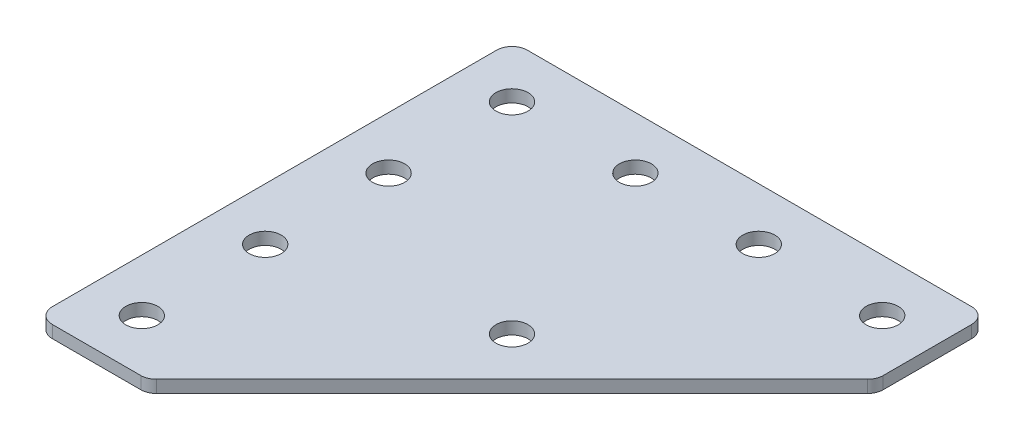
ISO-10303-21;
HEADER;
FILE_DESCRIPTION(('STEP AP214'),'2;1');
FILE_NAME('part.step','',(''),(''),'','','');
FILE_SCHEMA(('AUTOMOTIVE_DESIGN { 1 0 10303 214 1 1 1 1 }'));
ENDSEC;
DATA;
#1=APPLICATION_CONTEXT('core data for automotive mechanical design processes');
#2=APPLICATION_PROTOCOL_DEFINITION('international standard','automotive_design',2000,#1);
#3=PRODUCT_CONTEXT('',#1,'mechanical');
#4=PRODUCT('Part','Part','',(#3));
#5=PRODUCT_RELATED_PRODUCT_CATEGORY('part','',(#4));
#6=PRODUCT_DEFINITION_FORMATION('','',#4);
#7=PRODUCT_DEFINITION_CONTEXT('part definition',#1,'design');
#8=PRODUCT_DEFINITION('design','',#6,#7);
#9=PRODUCT_DEFINITION_SHAPE('','',#8);
#10=(LENGTH_UNIT() NAMED_UNIT(*) SI_UNIT(.MILLI.,.METRE.));
#11=(NAMED_UNIT(*) PLANE_ANGLE_UNIT() SI_UNIT($,.RADIAN.));
#12=(NAMED_UNIT(*) SI_UNIT($,.STERADIAN.) SOLID_ANGLE_UNIT());
#13=UNCERTAINTY_MEASURE_WITH_UNIT(LENGTH_MEASURE(1.E-05),#10,'distance_accuracy_value','');
#14=(GEOMETRIC_REPRESENTATION_CONTEXT(3) GLOBAL_UNCERTAINTY_ASSIGNED_CONTEXT((#13)) GLOBAL_UNIT_ASSIGNED_CONTEXT((#10,
#11,#12)) REPRESENTATION_CONTEXT('',''));
#15=CARTESIAN_POINT('',(0.,0.,0.));
#16=DIRECTION('',(0.,0.,1.));
#17=DIRECTION('',(1.,0.,0.));
#18=AXIS2_PLACEMENT_3D('',#15,#16,#17);
#19=CARTESIAN_POINT('',(-30.9410023545228,1.05807034319605,-31.1167335219397));
#20=DIRECTION('',(0.,-1.,0.));
#21=DIRECTION('',(0.,0.,-1.));
#22=AXIS2_PLACEMENT_3D('',#19,#20,#21);
#23=PLANE('',#22);
#24=CARTESIAN_POINT('',(1.63437644301843,1.05807034319605,1.45864527560156));
#25=DIRECTION('',(0.,-1.,0.));
#26=DIRECTION('',(0.,0.,-1.));
#27=AXIS2_PLACEMENT_3D('',#24,#25,#26);
#28=CIRCLE('',#27,2.6);
#29=CARTESIAN_POINT('',(1.63437644301843,1.05807034319605,-1.14135472439844));
#30=VERTEX_POINT('',#29);
#31=EDGE_CURVE('E226',#30,#30,#28,.T.);
#32=ORIENTED_EDGE('',*,*,#31,.F.);
#33=EDGE_LOOP('',(#32));
#34=FACE_BOUND('',#33,.T.);
#35=CARTESIAN_POINT('',(29.0589976454772,1.05807034319605,-31.1167335219397));
#36=DIRECTION('',(0.,1.,0.));
#37=DIRECTION('',(0.,0.,1.));
#38=AXIS2_PLACEMENT_3D('',#35,#36,#37);
#39=CIRCLE('',#38,2.6);
#40=CARTESIAN_POINT('',(29.0589976454772,1.05807034319605,-28.5167335219397));
#41=VERTEX_POINT('',#40);
#42=EDGE_CURVE('E220',#41,#41,#39,.T.);
#43=ORIENTED_EDGE('',*,*,#42,.T.);
#44=EDGE_LOOP('',(#43));
#45=FACE_BOUND('',#44,.T.);
#46=CARTESIAN_POINT('',(-30.9410023545228,1.05807034319605,28.8832664780603));
#47=DIRECTION('',(0.,1.,0.));
#48=DIRECTION('',(0.,0.,1.));
#49=AXIS2_PLACEMENT_3D('',#46,#47,#48);
#50=CIRCLE('',#49,2.6);
#51=CARTESIAN_POINT('',(-30.9410023545228,1.05807034319605,31.4832664780603));
#52=VERTEX_POINT('',#51);
#53=EDGE_CURVE('E214',#52,#52,#50,.T.);
#54=ORIENTED_EDGE('',*,*,#53,.T.);
#55=EDGE_LOOP('',(#54));
#56=FACE_BOUND('',#55,.T.);
#57=CARTESIAN_POINT('',(9.05899764547718,1.05807034319605,-31.1167335219397));
#58=DIRECTION('',(0.,1.,0.));
#59=DIRECTION('',(0.,0.,1.));
#60=AXIS2_PLACEMENT_3D('',#57,#58,#59);
#61=CIRCLE('',#60,2.6);
#62=CARTESIAN_POINT('',(9.05899764547718,1.05807034319605,-28.5167335219397));
#63=VERTEX_POINT('',#62);
#64=EDGE_CURVE('E208',#63,#63,#61,.T.);
#65=ORIENTED_EDGE('',*,*,#64,.T.);
#66=EDGE_LOOP('',(#65));
#67=FACE_BOUND('',#66,.T.);
#68=CARTESIAN_POINT('',(-30.9410023545228,1.05807034319605,8.88326647806029));
#69=DIRECTION('',(0.,1.,0.));
#70=DIRECTION('',(0.,0.,1.));
#71=AXIS2_PLACEMENT_3D('',#68,#69,#70);
#72=CIRCLE('',#71,2.6);
#73=CARTESIAN_POINT('',(-30.9410023545228,1.05807034319605,11.4832664780603));
#74=VERTEX_POINT('',#73);
#75=EDGE_CURVE('E202',#74,#74,#72,.T.);
#76=ORIENTED_EDGE('',*,*,#75,.T.);
#77=EDGE_LOOP('',(#76));
#78=FACE_BOUND('',#77,.T.);
#79=CARTESIAN_POINT('',(-30.9410023545228,1.05807034319605,-11.1167335219397));
#80=DIRECTION('',(0.,1.,0.));
#81=DIRECTION('',(0.,0.,1.));
#82=AXIS2_PLACEMENT_3D('',#79,#80,#81);
#83=CIRCLE('',#82,2.6);
#84=CARTESIAN_POINT('',(-30.9410023545228,1.05807034319605,-8.51673352193971));
#85=VERTEX_POINT('',#84);
#86=EDGE_CURVE('E196',#85,#85,#83,.T.);
#87=ORIENTED_EDGE('',*,*,#86,.T.);
#88=EDGE_LOOP('',(#87));
#89=FACE_BOUND('',#88,.T.);
#90=CARTESIAN_POINT('',(-10.9410023545228,1.05807034319605,-31.1167335219397));
#91=DIRECTION('',(0.,1.,0.));
#92=DIRECTION('',(0.,0.,1.));
#93=AXIS2_PLACEMENT_3D('',#90,#91,#92);
#94=CIRCLE('',#93,2.6);
#95=CARTESIAN_POINT('',(-10.9410023545228,1.05807034319605,-28.5167335219397));
#96=VERTEX_POINT('',#95);
#97=EDGE_CURVE('E190',#96,#96,#94,.T.);
#98=ORIENTED_EDGE('',*,*,#97,.T.);
#99=EDGE_LOOP('',(#98));
#100=FACE_BOUND('',#99,.T.);
#101=CARTESIAN_POINT('',(-30.9410023545228,1.05807034319605,-31.1167335219397));
#102=DIRECTION('',(0.,1.,0.));
#103=DIRECTION('',(0.,0.,1.));
#104=AXIS2_PLACEMENT_3D('',#101,#102,#103);
#105=CIRCLE('',#104,2.6);
#106=CARTESIAN_POINT('',(-30.9410023545228,1.05807034319605,-28.5167335219397));
#107=VERTEX_POINT('',#106);
#108=EDGE_CURVE('E180',#107,#107,#105,.T.);
#109=ORIENTED_EDGE('',*,*,#108,.T.);
#110=EDGE_LOOP('',(#109));
#111=FACE_BOUND('',#110,.T.);
#112=DIRECTION('',(1.,0.,0.));
#113=VECTOR('',#112,1.);
#114=CARTESIAN_POINT('',(-39.4410023545229,1.05807034319605,37.3832664780602));
#115=LINE('',#114,#113);
#116=CARTESIAN_POINT('',(-36.9410023545229,1.05807034319605,37.3832664780602));
#117=VERTEX_POINT('',#116);
#118=CARTESIAN_POINT('',(-22.5978566040151,1.05807034319605,37.3832664780603));
#119=VERTEX_POINT('',#118);
#120=EDGE_CURVE('E183',#117,#119,#115,.T.);
#121=ORIENTED_EDGE('',*,*,#120,.F.);
#122=CARTESIAN_POINT('',(-36.9410023545229,1.05807034319605,34.8832664780602));
#123=DIRECTION('',(0.,-1.,0.));
#124=DIRECTION('',(0.,0.,-1.));
#125=AXIS2_PLACEMENT_3D('',#122,#123,#124);
#126=CIRCLE('',#125,2.5);
#127=CARTESIAN_POINT('',(-39.4410023545229,1.05807034319605,34.8832664780602));
#128=VERTEX_POINT('',#127);
#129=EDGE_CURVE('E147',#117,#128,#126,.T.);
#130=ORIENTED_EDGE('',*,*,#129,.T.);
#131=DIRECTION('',(0.,0.,1.));
#132=VECTOR('',#131,1.);
#133=CARTESIAN_POINT('',(-39.4410023545229,1.05807034319605,-39.6167335219398));
#134=LINE('',#133,#132);
#135=CARTESIAN_POINT('',(-39.4410023545229,1.05807034319605,-37.1167335219398));
#136=VERTEX_POINT('',#135);
#137=EDGE_CURVE('E166',#136,#128,#134,.T.);
#138=ORIENTED_EDGE('',*,*,#137,.F.);
#139=CARTESIAN_POINT('',(-36.9410023545229,1.05807034319605,-37.1167335219398));
#140=DIRECTION('',(0.,-1.,0.));
#141=DIRECTION('',(0.,0.,-1.));
#142=AXIS2_PLACEMENT_3D('',#139,#140,#141);
#143=CIRCLE('',#142,2.5);
#144=CARTESIAN_POINT('',(-36.9410023545229,1.05807034319605,-39.6167335219398));
#145=VERTEX_POINT('',#144);
#146=EDGE_CURVE('E119',#136,#145,#143,.T.);
#147=ORIENTED_EDGE('',*,*,#146,.T.);
#148=DIRECTION('',(-1.,0.,0.));
#149=VECTOR('',#148,1.);
#150=CARTESIAN_POINT('',(37.5589976454771,1.05807034319605,-39.6167335219398));
#151=LINE('',#150,#149);
#152=CARTESIAN_POINT('',(35.0589976454771,1.05807034319605,-39.6167335219398));
#153=VERTEX_POINT('',#152);
#154=EDGE_CURVE('E162',#153,#145,#151,.T.);
#155=ORIENTED_EDGE('',*,*,#154,.F.);
#156=CARTESIAN_POINT('',(35.0589976454771,1.05807034319605,-37.1167335219398));
#157=DIRECTION('',(0.,-1.,0.));
#158=DIRECTION('',(0.,0.,-1.));
#159=AXIS2_PLACEMENT_3D('',#156,#157,#158);
#160=CIRCLE('',#159,2.5);
#161=CARTESIAN_POINT('',(37.5589976454771,1.05807034319605,-37.1167335219398));
#162=VERTEX_POINT('',#161);
#163=EDGE_CURVE('E145',#153,#162,#160,.T.);
#164=ORIENTED_EDGE('',*,*,#163,.T.);
#165=DIRECTION('',(0.,0.,-1.));
#166=VECTOR('',#165,1.);
#167=CARTESIAN_POINT('',(37.5589976454771,1.05807034319605,-21.7380538654993));
#168=LINE('',#167,#166);
#169=CARTESIAN_POINT('',(37.5589976454771,1.05807034319605,-22.773587771432));
#170=VERTEX_POINT('',#169);
#171=EDGE_CURVE('E120',#170,#162,#168,.T.);
#172=ORIENTED_EDGE('',*,*,#171,.F.);
#173=CARTESIAN_POINT('',(35.0589976454771,1.05807034319605,-22.773587771432));
#174=DIRECTION('',(0.,-1.,0.));
#175=DIRECTION('',(0.,0.,-1.));
#176=AXIS2_PLACEMENT_3D('',#173,#174,#175);
#177=CIRCLE('',#176,2.5);
#178=CARTESIAN_POINT('',(36.8267645984435,1.05807034319605,-21.0058208184657));
#179=VERTEX_POINT('',#178);
#180=EDGE_CURVE('E31',#170,#179,#177,.T.);
#181=ORIENTED_EDGE('',*,*,#180,.T.);
#182=DIRECTION('',(0.707106781186547,0.,-0.707106781186548));
#183=VECTOR('',#182,1.);
#184=CARTESIAN_POINT('',(-21.5623226980824,1.05807034319605,37.3832664780603));
#185=LINE('',#184,#183);
#186=CARTESIAN_POINT('',(-20.8300896510488,1.05807034319605,36.6510334310266));
#187=VERTEX_POINT('',#186);
#188=EDGE_CURVE('E125',#187,#179,#185,.T.);
#189=ORIENTED_EDGE('',*,*,#188,.F.);
#190=CARTESIAN_POINT('',(-22.5978566040151,1.05807034319605,34.8832664780603));
#191=DIRECTION('',(0.,-1.,0.));
#192=DIRECTION('',(0.,0.,-1.));
#193=AXIS2_PLACEMENT_3D('',#190,#191,#192);
#194=CIRCLE('',#193,2.5);
#195=EDGE_CURVE('E141',#187,#119,#194,.T.);
#196=ORIENTED_EDGE('',*,*,#195,.T.);
#197=EDGE_LOOP('',(#121,#130,#138,#147,#155,#164,#172,#181,#189,#196));
#198=FACE_BOUND('',#197,.T.);
#199=ADVANCED_FACE('F16',(#34,#45,#56,#67,#78,#89,#100,#111,#198),#23,.T.);
#200=CARTESIAN_POINT('',(37.5589976454771,1.05807034319605,-39.6167335219398));
#201=DIRECTION('',(0.,0.,-1.));
#202=DIRECTION('',(-1.,0.,0.));
#203=AXIS2_PLACEMENT_3D('',#200,#201,#202);
#204=PLANE('',#203);
#205=DIRECTION('',(-1.,0.,0.));
#206=VECTOR('',#205,1.);
#207=CARTESIAN_POINT('',(37.5589976454771,3.05807034319605,-39.6167335219398));
#208=LINE('',#207,#206);
#209=CARTESIAN_POINT('',(35.0589976454771,3.05807034319605,-39.6167335219398));
#210=VERTEX_POINT('',#209);
#211=CARTESIAN_POINT('',(-36.9410023545229,3.05807034319605,-39.6167335219398));
#212=VERTEX_POINT('',#211);
#213=EDGE_CURVE('E99',#210,#212,#208,.T.);
#214=ORIENTED_EDGE('',*,*,#213,.F.);
#215=DIRECTION('',(0.,1.,0.));
#216=VECTOR('',#215,1.);
#217=CARTESIAN_POINT('',(35.0589976454771,1.05807034319605,-39.6167335219398));
#218=LINE('',#217,#216);
#219=EDGE_CURVE('E156',#210,#153,#218,.F.);
#220=ORIENTED_EDGE('',*,*,#219,.T.);
#221=ORIENTED_EDGE('',*,*,#154,.T.);
#222=DIRECTION('',(0.,1.,0.));
#223=VECTOR('',#222,1.);
#224=CARTESIAN_POINT('',(-36.9410023545229,1.05807034319605,-39.6167335219398));
#225=LINE('',#224,#223);
#226=EDGE_CURVE('E154',#145,#212,#225,.T.);
#227=ORIENTED_EDGE('',*,*,#226,.T.);
#228=EDGE_LOOP('',(#214,#220,#221,#227));
#229=FACE_BOUND('',#228,.T.);
#230=ADVANCED_FACE('F161',(#229),#204,.T.);
#231=CARTESIAN_POINT('',(37.5589976454771,1.05807034319605,-21.7380538654993));
#232=DIRECTION('',(1.,0.,0.));
#233=DIRECTION('',(0.,0.,-1.));
#234=AXIS2_PLACEMENT_3D('',#231,#232,#233);
#235=PLANE('',#234);
#236=ORIENTED_EDGE('',*,*,#171,.T.);
#237=DIRECTION('',(0.,1.,0.));
#238=VECTOR('',#237,1.);
#239=CARTESIAN_POINT('',(37.5589976454771,1.05807034319605,-37.1167335219398));
#240=LINE('',#239,#238);
#241=CARTESIAN_POINT('',(37.5589976454771,3.05807034319605,-37.1167335219398));
#242=VERTEX_POINT('',#241);
#243=EDGE_CURVE('E151',#162,#242,#240,.T.);
#244=ORIENTED_EDGE('',*,*,#243,.T.);
#245=DIRECTION('',(0.,0.,-1.));
#246=VECTOR('',#245,1.);
#247=CARTESIAN_POINT('',(37.5589976454771,3.05807034319605,-21.7380538654993));
#248=LINE('',#247,#246);
#249=CARTESIAN_POINT('',(37.5589976454771,3.05807034319605,-22.773587771432));
#250=VERTEX_POINT('',#249);
#251=EDGE_CURVE('E128',#250,#242,#248,.T.);
#252=ORIENTED_EDGE('',*,*,#251,.F.);
#253=DIRECTION('',(0.,1.,0.));
#254=VECTOR('',#253,1.);
#255=CARTESIAN_POINT('',(37.5589976454771,1.05807034319605,-22.773587771432));
#256=LINE('',#255,#254);
#257=EDGE_CURVE('E149',#250,#170,#256,.F.);
#258=ORIENTED_EDGE('',*,*,#257,.T.);
#259=EDGE_LOOP('',(#236,#244,#252,#258));
#260=FACE_BOUND('',#259,.T.);
#261=ADVANCED_FACE('F173',(#260),#235,.T.);
#262=CARTESIAN_POINT('',(-21.5623226980824,1.05807034319605,37.3832664780603));
#263=DIRECTION('',(0.707106781186548,0.,0.707106781186547));
#264=DIRECTION('',(0.707106781186547,0.,-0.707106781186548));
#265=AXIS2_PLACEMENT_3D('',#262,#263,#264);
#266=PLANE('',#265);
#267=ORIENTED_EDGE('',*,*,#188,.T.);
#268=DIRECTION('',(0.,1.,0.));
#269=VECTOR('',#268,1.);
#270=CARTESIAN_POINT('',(36.8267645984435,1.05807034319605,-21.0058208184657));
#271=LINE('',#270,#269);
#272=CARTESIAN_POINT('',(36.8267645984435,3.05807034319605,-21.0058208184657));
#273=VERTEX_POINT('',#272);
#274=EDGE_CURVE('E10',#179,#273,#271,.T.);
#275=ORIENTED_EDGE('',*,*,#274,.T.);
#276=DIRECTION('',(0.707106781186547,0.,-0.707106781186548));
#277=VECTOR('',#276,1.);
#278=CARTESIAN_POINT('',(-21.5623226980824,3.05807034319605,37.3832664780603));
#279=LINE('',#278,#277);
#280=CARTESIAN_POINT('',(-20.8300896510488,3.05807034319605,36.6510334310266));
#281=VERTEX_POINT('',#280);
#282=EDGE_CURVE('E176',#281,#273,#279,.T.);
#283=ORIENTED_EDGE('',*,*,#282,.F.);
#284=DIRECTION('',(0.,1.,0.));
#285=VECTOR('',#284,1.);
#286=CARTESIAN_POINT('',(-20.8300896510488,1.05807034319605,36.6510334310266));
#287=LINE('',#286,#285);
#288=EDGE_CURVE('E24',#281,#187,#287,.F.);
#289=ORIENTED_EDGE('',*,*,#288,.T.);
#290=EDGE_LOOP('',(#267,#275,#283,#289));
#291=FACE_BOUND('',#290,.T.);
#292=ADVANCED_FACE('F294',(#291),#266,.T.);
#293=CARTESIAN_POINT('',(-39.4410023545229,1.05807034319605,37.3832664780602));
#294=DIRECTION('',(0.,0.,1.));
#295=DIRECTION('',(1.,0.,0.));
#296=AXIS2_PLACEMENT_3D('',#293,#294,#295);
#297=PLANE('',#296);
#298=DIRECTION('',(1.,0.,0.));
#299=VECTOR('',#298,1.);
#300=CARTESIAN_POINT('',(-39.4410023545229,3.05807034319605,37.3832664780602));
#301=LINE('',#300,#299);
#302=CARTESIAN_POINT('',(-36.9410023545229,3.05807034319605,37.3832664780602));
#303=VERTEX_POINT('',#302);
#304=CARTESIAN_POINT('',(-22.5978566040151,3.05807034319605,37.3832664780603));
#305=VERTEX_POINT('',#304);
#306=EDGE_CURVE('E115',#303,#305,#301,.T.);
#307=ORIENTED_EDGE('',*,*,#306,.F.);
#308=DIRECTION('',(0.,1.,0.));
#309=VECTOR('',#308,1.);
#310=CARTESIAN_POINT('',(-36.9410023545229,1.05807034319605,37.3832664780602));
#311=LINE('',#310,#309);
#312=EDGE_CURVE('E139',#303,#117,#311,.F.);
#313=ORIENTED_EDGE('',*,*,#312,.T.);
#314=ORIENTED_EDGE('',*,*,#120,.T.);
#315=DIRECTION('',(0.,1.,0.));
#316=VECTOR('',#315,1.);
#317=CARTESIAN_POINT('',(-22.5978566040151,1.05807034319605,37.3832664780603));
#318=LINE('',#317,#316);
#319=EDGE_CURVE('E136',#119,#305,#318,.T.);
#320=ORIENTED_EDGE('',*,*,#319,.T.);
#321=EDGE_LOOP('',(#307,#313,#314,#320));
#322=FACE_BOUND('',#321,.T.);
#323=ADVANCED_FACE('F299',(#322),#297,.T.);
#324=CARTESIAN_POINT('',(-39.4410023545229,1.05807034319605,-39.6167335219398));
#325=DIRECTION('',(-1.,0.,0.));
#326=DIRECTION('',(0.,0.,1.));
#327=AXIS2_PLACEMENT_3D('',#324,#325,#326);
#328=PLANE('',#327);
#329=ORIENTED_EDGE('',*,*,#137,.T.);
#330=DIRECTION('',(0.,1.,0.));
#331=VECTOR('',#330,1.);
#332=CARTESIAN_POINT('',(-39.4410023545229,1.05807034319605,34.8832664780602));
#333=LINE('',#332,#331);
#334=CARTESIAN_POINT('',(-39.4410023545229,3.05807034319605,34.8832664780602));
#335=VERTEX_POINT('',#334);
#336=EDGE_CURVE('E114',#128,#335,#333,.T.);
#337=ORIENTED_EDGE('',*,*,#336,.T.);
#338=DIRECTION('',(0.,0.,1.));
#339=VECTOR('',#338,1.);
#340=CARTESIAN_POINT('',(-39.4410023545229,3.05807034319605,-39.6167335219398));
#341=LINE('',#340,#339);
#342=CARTESIAN_POINT('',(-39.4410023545229,3.05807034319605,-37.1167335219398));
#343=VERTEX_POINT('',#342);
#344=EDGE_CURVE('E97',#343,#335,#341,.T.);
#345=ORIENTED_EDGE('',*,*,#344,.F.);
#346=DIRECTION('',(0.,1.,0.));
#347=VECTOR('',#346,1.);
#348=CARTESIAN_POINT('',(-39.4410023545229,1.05807034319605,-37.1167335219398));
#349=LINE('',#348,#347);
#350=EDGE_CURVE('E111',#343,#136,#349,.F.);
#351=ORIENTED_EDGE('',*,*,#350,.T.);
#352=EDGE_LOOP('',(#329,#337,#345,#351));
#353=FACE_BOUND('',#352,.T.);
#354=ADVANCED_FACE('F110',(#353),#328,.T.);
#355=CARTESIAN_POINT('',(-30.9410023545228,3.05807034319605,-31.1167335219397));
#356=DIRECTION('',(0.,-1.,0.));
#357=DIRECTION('',(0.,0.,-1.));
#358=AXIS2_PLACEMENT_3D('',#355,#356,#357);
#359=PLANE('',#358);
#360=CARTESIAN_POINT('',(1.63437644301843,3.05807034319605,1.45864527560156));
#361=DIRECTION('',(0.,1.,0.));
#362=DIRECTION('',(0.,0.,1.));
#363=AXIS2_PLACEMENT_3D('',#360,#361,#362);
#364=CIRCLE('',#363,2.6);
#365=CARTESIAN_POINT('',(1.63437644301843,3.05807034319605,4.05864527560155));
#366=VERTEX_POINT('',#365);
#367=EDGE_CURVE('E231',#366,#366,#364,.T.);
#368=ORIENTED_EDGE('',*,*,#367,.F.);
#369=EDGE_LOOP('',(#368));
#370=FACE_BOUND('',#369,.T.);
#371=CARTESIAN_POINT('',(29.0589976454772,3.05807034319605,-31.1167335219397));
#372=DIRECTION('',(0.,1.,0.));
#373=DIRECTION('',(0.,0.,1.));
#374=AXIS2_PLACEMENT_3D('',#371,#372,#373);
#375=CIRCLE('',#374,2.6);
#376=CARTESIAN_POINT('',(29.0589976454772,3.05807034319605,-28.5167335219397));
#377=VERTEX_POINT('',#376);
#378=EDGE_CURVE('E223',#377,#377,#375,.T.);
#379=ORIENTED_EDGE('',*,*,#378,.F.);
#380=EDGE_LOOP('',(#379));
#381=FACE_BOUND('',#380,.T.);
#382=CARTESIAN_POINT('',(-30.9410023545228,3.05807034319605,28.8832664780603));
#383=DIRECTION('',(0.,1.,0.));
#384=DIRECTION('',(0.,0.,1.));
#385=AXIS2_PLACEMENT_3D('',#382,#383,#384);
#386=CIRCLE('',#385,2.6);
#387=CARTESIAN_POINT('',(-30.9410023545228,3.05807034319605,31.4832664780603));
#388=VERTEX_POINT('',#387);
#389=EDGE_CURVE('E217',#388,#388,#386,.T.);
#390=ORIENTED_EDGE('',*,*,#389,.F.);
#391=EDGE_LOOP('',(#390));
#392=FACE_BOUND('',#391,.T.);
#393=CARTESIAN_POINT('',(9.05899764547718,3.05807034319605,-31.1167335219397));
#394=DIRECTION('',(0.,1.,0.));
#395=DIRECTION('',(0.,0.,1.));
#396=AXIS2_PLACEMENT_3D('',#393,#394,#395);
#397=CIRCLE('',#396,2.6);
#398=CARTESIAN_POINT('',(9.05899764547718,3.05807034319605,-28.5167335219397));
#399=VERTEX_POINT('',#398);
#400=EDGE_CURVE('E211',#399,#399,#397,.T.);
#401=ORIENTED_EDGE('',*,*,#400,.F.);
#402=EDGE_LOOP('',(#401));
#403=FACE_BOUND('',#402,.T.);
#404=CARTESIAN_POINT('',(-30.9410023545228,3.05807034319605,8.88326647806029));
#405=DIRECTION('',(0.,1.,0.));
#406=DIRECTION('',(0.,0.,1.));
#407=AXIS2_PLACEMENT_3D('',#404,#405,#406);
#408=CIRCLE('',#407,2.6);
#409=CARTESIAN_POINT('',(-30.9410023545228,3.05807034319605,11.4832664780603));
#410=VERTEX_POINT('',#409);
#411=EDGE_CURVE('E205',#410,#410,#408,.T.);
#412=ORIENTED_EDGE('',*,*,#411,.F.);
#413=EDGE_LOOP('',(#412));
#414=FACE_BOUND('',#413,.T.);
#415=CARTESIAN_POINT('',(-30.9410023545228,3.05807034319605,-11.1167335219397));
#416=DIRECTION('',(0.,1.,0.));
#417=DIRECTION('',(0.,0.,1.));
#418=AXIS2_PLACEMENT_3D('',#415,#416,#417);
#419=CIRCLE('',#418,2.6);
#420=CARTESIAN_POINT('',(-30.9410023545228,3.05807034319605,-8.51673352193971));
#421=VERTEX_POINT('',#420);
#422=EDGE_CURVE('E199',#421,#421,#419,.T.);
#423=ORIENTED_EDGE('',*,*,#422,.F.);
#424=EDGE_LOOP('',(#423));
#425=FACE_BOUND('',#424,.T.);
#426=CARTESIAN_POINT('',(-10.9410023545228,3.05807034319605,-31.1167335219397));
#427=DIRECTION('',(0.,1.,0.));
#428=DIRECTION('',(0.,0.,1.));
#429=AXIS2_PLACEMENT_3D('',#426,#427,#428);
#430=CIRCLE('',#429,2.6);
#431=CARTESIAN_POINT('',(-10.9410023545228,3.05807034319605,-28.5167335219397));
#432=VERTEX_POINT('',#431);
#433=EDGE_CURVE('E193',#432,#432,#430,.T.);
#434=ORIENTED_EDGE('',*,*,#433,.F.);
#435=EDGE_LOOP('',(#434));
#436=FACE_BOUND('',#435,.T.);
#437=CARTESIAN_POINT('',(-30.9410023545228,3.05807034319605,-31.1167335219397));
#438=DIRECTION('',(0.,1.,0.));
#439=DIRECTION('',(0.,0.,1.));
#440=AXIS2_PLACEMENT_3D('',#437,#438,#439);
#441=CIRCLE('',#440,2.6);
#442=CARTESIAN_POINT('',(-30.9410023545228,3.05807034319605,-28.5167335219397));
#443=VERTEX_POINT('',#442);
#444=EDGE_CURVE('E187',#443,#443,#441,.T.);
#445=ORIENTED_EDGE('',*,*,#444,.F.);
#446=EDGE_LOOP('',(#445));
#447=FACE_BOUND('',#446,.T.);
#448=ORIENTED_EDGE('',*,*,#344,.T.);
#449=CARTESIAN_POINT('',(-36.9410023545229,3.05807034319605,34.8832664780602));
#450=DIRECTION('',(0.,-1.,0.));
#451=DIRECTION('',(0.,0.,-1.));
#452=AXIS2_PLACEMENT_3D('',#449,#450,#451);
#453=CIRCLE('',#452,2.5);
#454=EDGE_CURVE('E134',#335,#303,#453,.F.);
#455=ORIENTED_EDGE('',*,*,#454,.T.);
#456=ORIENTED_EDGE('',*,*,#306,.T.);
#457=CARTESIAN_POINT('',(-22.5978566040151,3.05807034319605,34.8832664780603));
#458=DIRECTION('',(0.,-1.,0.));
#459=DIRECTION('',(0.,0.,-1.));
#460=AXIS2_PLACEMENT_3D('',#457,#458,#459);
#461=CIRCLE('',#460,2.5);
#462=EDGE_CURVE('E122',#305,#281,#461,.F.);
#463=ORIENTED_EDGE('',*,*,#462,.T.);
#464=ORIENTED_EDGE('',*,*,#282,.T.);
#465=CARTESIAN_POINT('',(35.0589976454771,3.05807034319605,-22.773587771432));
#466=DIRECTION('',(0.,-1.,0.));
#467=DIRECTION('',(0.,0.,-1.));
#468=AXIS2_PLACEMENT_3D('',#465,#466,#467);
#469=CIRCLE('',#468,2.5);
#470=EDGE_CURVE('E105',#273,#250,#469,.F.);
#471=ORIENTED_EDGE('',*,*,#470,.T.);
#472=ORIENTED_EDGE('',*,*,#251,.T.);
#473=CARTESIAN_POINT('',(35.0589976454771,3.05807034319605,-37.1167335219398));
#474=DIRECTION('',(0.,-1.,0.));
#475=DIRECTION('',(0.,0.,-1.));
#476=AXIS2_PLACEMENT_3D('',#473,#474,#475);
#477=CIRCLE('',#476,2.5);
#478=EDGE_CURVE('E104',#242,#210,#477,.F.);
#479=ORIENTED_EDGE('',*,*,#478,.T.);
#480=ORIENTED_EDGE('',*,*,#213,.T.);
#481=CARTESIAN_POINT('',(-36.9410023545229,3.05807034319605,-37.1167335219398));
#482=DIRECTION('',(0.,-1.,0.));
#483=DIRECTION('',(0.,0.,-1.));
#484=AXIS2_PLACEMENT_3D('',#481,#482,#483);
#485=CIRCLE('',#484,2.5);
#486=EDGE_CURVE('E94',#212,#343,#485,.F.);
#487=ORIENTED_EDGE('',*,*,#486,.T.);
#488=EDGE_LOOP('',(#448,#455,#456,#463,#464,#471,#472,#479,#480,#487));
#489=FACE_BOUND('',#488,.T.);
#490=ADVANCED_FACE('F96',(#370,#381,#392,#403,#414,#425,#436,#447,#489),#359,.F.);
#491=CARTESIAN_POINT('',(-30.9410023545228,1.05807034319605,-31.1167335219397));
#492=DIRECTION('',(0.,1.,0.));
#493=DIRECTION('',(0.,0.,1.));
#494=AXIS2_PLACEMENT_3D('',#491,#492,#493);
#495=CYLINDRICAL_SURFACE('',#494,2.6);
#496=ORIENTED_EDGE('',*,*,#108,.F.);
#497=EDGE_LOOP('',(#496));
#498=FACE_BOUND('',#497,.T.);
#499=ORIENTED_EDGE('',*,*,#444,.T.);
#500=EDGE_LOOP('',(#499));
#501=FACE_BOUND('',#500,.T.);
#502=ADVANCED_FACE('F239',(#498,#501),#495,.F.);
#503=CARTESIAN_POINT('',(-10.9410023545228,1.05807034319605,-31.1167335219397));
#504=DIRECTION('',(0.,1.,0.));
#505=DIRECTION('',(0.,0.,1.));
#506=AXIS2_PLACEMENT_3D('',#503,#504,#505);
#507=CYLINDRICAL_SURFACE('',#506,2.6);
#508=ORIENTED_EDGE('',*,*,#97,.F.);
#509=EDGE_LOOP('',(#508));
#510=FACE_BOUND('',#509,.T.);
#511=ORIENTED_EDGE('',*,*,#433,.T.);
#512=EDGE_LOOP('',(#511));
#513=FACE_BOUND('',#512,.T.);
#514=ADVANCED_FACE('F256',(#510,#513),#507,.F.);
#515=CARTESIAN_POINT('',(-30.9410023545228,1.05807034319605,-11.1167335219397));
#516=DIRECTION('',(0.,1.,0.));
#517=DIRECTION('',(0.,0.,1.));
#518=AXIS2_PLACEMENT_3D('',#515,#516,#517);
#519=CYLINDRICAL_SURFACE('',#518,2.6);
#520=ORIENTED_EDGE('',*,*,#86,.F.);
#521=EDGE_LOOP('',(#520));
#522=FACE_BOUND('',#521,.T.);
#523=ORIENTED_EDGE('',*,*,#422,.T.);
#524=EDGE_LOOP('',(#523));
#525=FACE_BOUND('',#524,.T.);
#526=ADVANCED_FACE('F263',(#522,#525),#519,.F.);
#527=CARTESIAN_POINT('',(-30.9410023545228,1.05807034319605,8.88326647806029));
#528=DIRECTION('',(0.,1.,0.));
#529=DIRECTION('',(0.,0.,1.));
#530=AXIS2_PLACEMENT_3D('',#527,#528,#529);
#531=CYLINDRICAL_SURFACE('',#530,2.6);
#532=ORIENTED_EDGE('',*,*,#75,.F.);
#533=EDGE_LOOP('',(#532));
#534=FACE_BOUND('',#533,.T.);
#535=ORIENTED_EDGE('',*,*,#411,.T.);
#536=EDGE_LOOP('',(#535));
#537=FACE_BOUND('',#536,.T.);
#538=ADVANCED_FACE('F359',(#534,#537),#531,.F.);
#539=CARTESIAN_POINT('',(9.05899764547718,1.05807034319605,-31.1167335219397));
#540=DIRECTION('',(0.,1.,0.));
#541=DIRECTION('',(0.,0.,1.));
#542=AXIS2_PLACEMENT_3D('',#539,#540,#541);
#543=CYLINDRICAL_SURFACE('',#542,2.6);
#544=ORIENTED_EDGE('',*,*,#64,.F.);
#545=EDGE_LOOP('',(#544));
#546=FACE_BOUND('',#545,.T.);
#547=ORIENTED_EDGE('',*,*,#400,.T.);
#548=EDGE_LOOP('',(#547));
#549=FACE_BOUND('',#548,.T.);
#550=ADVANCED_FACE('F369',(#546,#549),#543,.F.);
#551=CARTESIAN_POINT('',(-30.9410023545228,1.05807034319605,28.8832664780603));
#552=DIRECTION('',(0.,1.,0.));
#553=DIRECTION('',(0.,0.,1.));
#554=AXIS2_PLACEMENT_3D('',#551,#552,#553);
#555=CYLINDRICAL_SURFACE('',#554,2.6);
#556=ORIENTED_EDGE('',*,*,#53,.F.);
#557=EDGE_LOOP('',(#556));
#558=FACE_BOUND('',#557,.T.);
#559=ORIENTED_EDGE('',*,*,#389,.T.);
#560=EDGE_LOOP('',(#559));
#561=FACE_BOUND('',#560,.T.);
#562=ADVANCED_FACE('F379',(#558,#561),#555,.F.);
#563=CARTESIAN_POINT('',(29.0589976454772,1.05807034319605,-31.1167335219397));
#564=DIRECTION('',(0.,1.,0.));
#565=DIRECTION('',(0.,0.,1.));
#566=AXIS2_PLACEMENT_3D('',#563,#564,#565);
#567=CYLINDRICAL_SURFACE('',#566,2.6);
#568=ORIENTED_EDGE('',*,*,#42,.F.);
#569=EDGE_LOOP('',(#568));
#570=FACE_BOUND('',#569,.T.);
#571=ORIENTED_EDGE('',*,*,#378,.T.);
#572=EDGE_LOOP('',(#571));
#573=FACE_BOUND('',#572,.T.);
#574=ADVANCED_FACE('F281',(#570,#573),#567,.F.);
#575=CARTESIAN_POINT('',(-36.9410023545229,1.05807034319605,34.8832664780602));
#576=DIRECTION('',(0.,1.,0.));
#577=DIRECTION('',(0.,0.,1.));
#578=AXIS2_PLACEMENT_3D('',#575,#576,#577);
#579=CYLINDRICAL_SURFACE('',#578,2.5);
#580=ORIENTED_EDGE('',*,*,#129,.F.);
#581=ORIENTED_EDGE('',*,*,#312,.F.);
#582=ORIENTED_EDGE('',*,*,#454,.F.);
#583=ORIENTED_EDGE('',*,*,#336,.F.);
#584=EDGE_LOOP('',(#580,#581,#582,#583));
#585=FACE_BOUND('',#584,.T.);
#586=ADVANCED_FACE('F278',(#585),#579,.T.);
#587=CARTESIAN_POINT('',(35.0589976454771,1.05807034319605,-37.1167335219398));
#588=DIRECTION('',(0.,1.,0.));
#589=DIRECTION('',(0.,0.,1.));
#590=AXIS2_PLACEMENT_3D('',#587,#588,#589);
#591=CYLINDRICAL_SURFACE('',#590,2.5);
#592=ORIENTED_EDGE('',*,*,#163,.F.);
#593=ORIENTED_EDGE('',*,*,#219,.F.);
#594=ORIENTED_EDGE('',*,*,#478,.F.);
#595=ORIENTED_EDGE('',*,*,#243,.F.);
#596=EDGE_LOOP('',(#592,#593,#594,#595));
#597=FACE_BOUND('',#596,.T.);
#598=ADVANCED_FACE('F169',(#597),#591,.T.);
#599=CARTESIAN_POINT('',(-36.9410023545229,1.05807034319605,-37.1167335219398));
#600=DIRECTION('',(0.,1.,0.));
#601=DIRECTION('',(0.,0.,1.));
#602=AXIS2_PLACEMENT_3D('',#599,#600,#601);
#603=CYLINDRICAL_SURFACE('',#602,2.5);
#604=ORIENTED_EDGE('',*,*,#146,.F.);
#605=ORIENTED_EDGE('',*,*,#350,.F.);
#606=ORIENTED_EDGE('',*,*,#486,.F.);
#607=ORIENTED_EDGE('',*,*,#226,.F.);
#608=EDGE_LOOP('',(#604,#605,#606,#607));
#609=FACE_BOUND('',#608,.T.);
#610=ADVANCED_FACE('F118',(#609),#603,.T.);
#611=CARTESIAN_POINT('',(35.0589976454771,1.05807034319605,-22.773587771432));
#612=DIRECTION('',(0.,1.,0.));
#613=DIRECTION('',(0.,0.,1.));
#614=AXIS2_PLACEMENT_3D('',#611,#612,#613);
#615=CYLINDRICAL_SURFACE('',#614,2.5);
#616=ORIENTED_EDGE('',*,*,#180,.F.);
#617=ORIENTED_EDGE('',*,*,#257,.F.);
#618=ORIENTED_EDGE('',*,*,#470,.F.);
#619=ORIENTED_EDGE('',*,*,#274,.F.);
#620=EDGE_LOOP('',(#616,#617,#618,#619));
#621=FACE_BOUND('',#620,.T.);
#622=ADVANCED_FACE('F286',(#621),#615,.T.);
#623=CARTESIAN_POINT('',(-22.5978566040151,1.05807034319605,34.8832664780603));
#624=DIRECTION('',(0.,1.,0.));
#625=DIRECTION('',(0.,0.,1.));
#626=AXIS2_PLACEMENT_3D('',#623,#624,#625);
#627=CYLINDRICAL_SURFACE('',#626,2.5);
#628=ORIENTED_EDGE('',*,*,#195,.F.);
#629=ORIENTED_EDGE('',*,*,#288,.F.);
#630=ORIENTED_EDGE('',*,*,#462,.F.);
#631=ORIENTED_EDGE('',*,*,#319,.F.);
#632=EDGE_LOOP('',(#628,#629,#630,#631));
#633=FACE_BOUND('',#632,.T.);
#634=ADVANCED_FACE('F18',(#633),#627,.T.);
#635=CARTESIAN_POINT('',(1.63437644301843,-6.94192965680395,1.45864527560156));
#636=DIRECTION('',(0.,1.,0.));
#637=DIRECTION('',(0.,0.,1.));
#638=AXIS2_PLACEMENT_3D('',#635,#636,#637);
#639=CYLINDRICAL_SURFACE('',#638,2.6);
#640=ORIENTED_EDGE('',*,*,#31,.T.);
#641=EDGE_LOOP('',(#640));
#642=FACE_BOUND('',#641,.T.);
#643=ORIENTED_EDGE('',*,*,#367,.T.);
#644=EDGE_LOOP('',(#643));
#645=FACE_BOUND('',#644,.T.);
#646=ADVANCED_FACE('F235',(#642,#645),#639,.F.);
#647=CLOSED_SHELL('',(#199,#230,#261,#292,#323,#354,#490,#502,#514,#526,#538,#550,#562,#574,
#586,#598,#610,#622,#634,#646));
#648=MANIFOLD_SOLID_BREP('B1',#647);
#649=ADVANCED_BREP_SHAPE_REPRESENTATION('',(#18,#648),#14);
#650=SHAPE_DEFINITION_REPRESENTATION(#9,#649);
ENDSEC;
END-ISO-10303-21;
